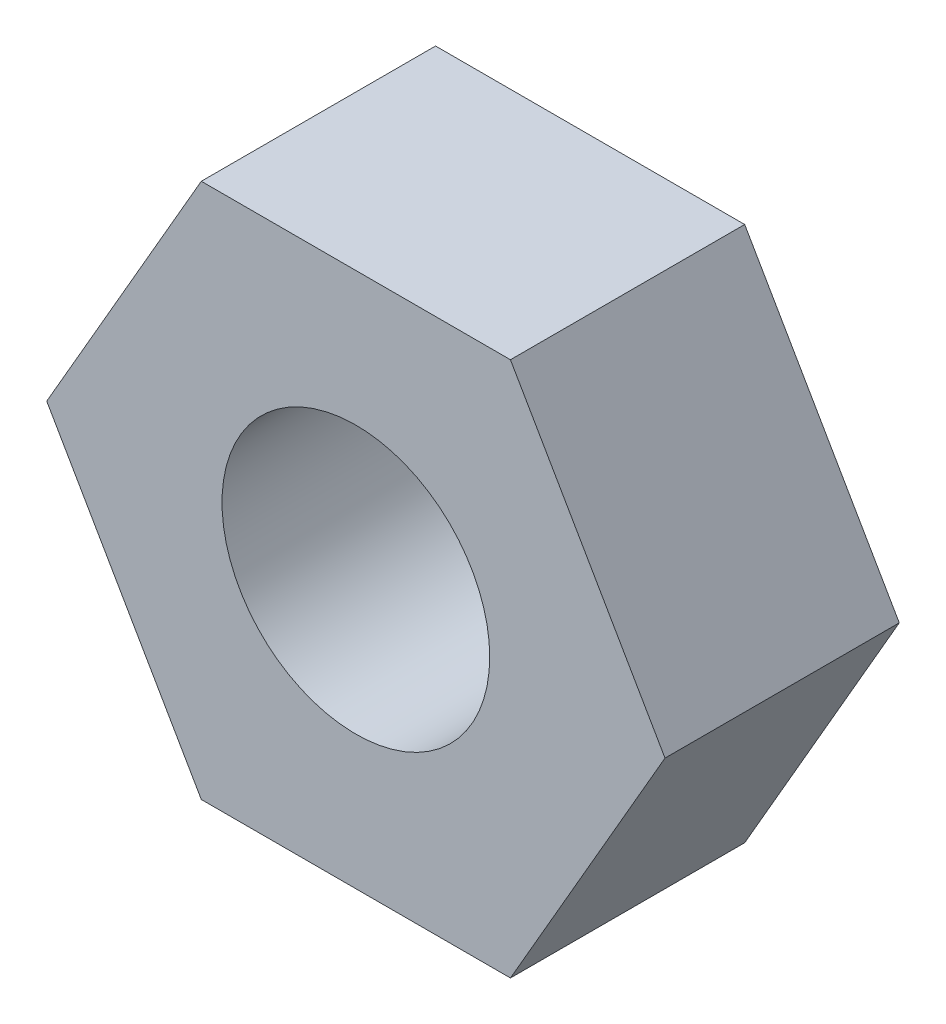
ISO-10303-21;
HEADER;
FILE_DESCRIPTION(('STEP AP214'),'2;1');
FILE_NAME('part.step','',(''),(''),'','','');
FILE_SCHEMA(('AUTOMOTIVE_DESIGN { 1 0 10303 214 1 1 1 1 }'));
ENDSEC;
DATA;
#1=APPLICATION_CONTEXT('core data for automotive mechanical design processes');
#2=APPLICATION_PROTOCOL_DEFINITION('international standard','automotive_design',2000,#1);
#3=PRODUCT_CONTEXT('',#1,'mechanical');
#4=PRODUCT('Part','Part','',(#3));
#5=PRODUCT_RELATED_PRODUCT_CATEGORY('part','',(#4));
#6=PRODUCT_DEFINITION_FORMATION('','',#4);
#7=PRODUCT_DEFINITION_CONTEXT('part definition',#1,'design');
#8=PRODUCT_DEFINITION('design','',#6,#7);
#9=PRODUCT_DEFINITION_SHAPE('','',#8);
#10=(LENGTH_UNIT() NAMED_UNIT(*) SI_UNIT(.MILLI.,.METRE.));
#11=(NAMED_UNIT(*) PLANE_ANGLE_UNIT() SI_UNIT($,.RADIAN.));
#12=(NAMED_UNIT(*) SI_UNIT($,.STERADIAN.) SOLID_ANGLE_UNIT());
#13=UNCERTAINTY_MEASURE_WITH_UNIT(LENGTH_MEASURE(1.E-05),#10,'distance_accuracy_value','');
#14=(GEOMETRIC_REPRESENTATION_CONTEXT(3) GLOBAL_UNCERTAINTY_ASSIGNED_CONTEXT((#13)) GLOBAL_UNIT_ASSIGNED_CONTEXT((#10,
#11,#12)) REPRESENTATION_CONTEXT('',''));
#15=CARTESIAN_POINT('',(0.,0.,0.));
#16=DIRECTION('',(0.,0.,1.));
#17=DIRECTION('',(1.,0.,0.));
#18=AXIS2_PLACEMENT_3D('',#15,#16,#17);
#19=CARTESIAN_POINT('',(0.,0.,14.));
#20=DIRECTION('',(0.,0.,1.));
#21=DIRECTION('',(1.,0.,0.));
#22=AXIS2_PLACEMENT_3D('',#19,#20,#21);
#23=PLANE('',#22);
#24=DIRECTION('',(-1.,0.,0.));
#25=VECTOR('',#24,1.);
#26=CARTESIAN_POINT('',(9.23760430703395,16.,14.));
#27=LINE('',#26,#25);
#28=CARTESIAN_POINT('',(9.23760430703395,16.,14.));
#29=VERTEX_POINT('',#28);
#30=CARTESIAN_POINT('',(-9.23760430703405,15.9999999999999,14.));
#31=VERTEX_POINT('',#30);
#32=EDGE_CURVE('E150',#29,#31,#27,.T.);
#33=ORIENTED_EDGE('',*,*,#32,.T.);
#34=DIRECTION('',(-0.499999999999995,-0.866025403784442,0.));
#35=VECTOR('',#34,1.);
#36=CARTESIAN_POINT('',(-9.23760430703405,15.9999999999999,14.));
#37=LINE('',#36,#35);
#38=CARTESIAN_POINT('',(-18.475208614068,-1.29011692214504E-13,14.));
#39=VERTEX_POINT('',#38);
#40=EDGE_CURVE('E108',#31,#39,#37,.T.);
#41=ORIENTED_EDGE('',*,*,#40,.T.);
#42=DIRECTION('',(0.500000000000007,-0.866025403784435,0.));
#43=VECTOR('',#42,1.);
#44=CARTESIAN_POINT('',(-18.475208614068,-1.29011692214504E-13,14.));
#45=LINE('',#44,#43);
#46=CARTESIAN_POINT('',(-9.23760430703383,-16.,14.));
#47=VERTEX_POINT('',#46);
#48=EDGE_CURVE('E121',#39,#47,#45,.T.);
#49=ORIENTED_EDGE('',*,*,#48,.T.);
#50=DIRECTION('',(1.,0.,0.));
#51=VECTOR('',#50,1.);
#52=CARTESIAN_POINT('',(-9.23760430703383,-16.,14.));
#53=LINE('',#52,#51);
#54=CARTESIAN_POINT('',(9.23760430703417,-15.9999999999998,14.));
#55=VERTEX_POINT('',#54);
#56=EDGE_CURVE('E115',#47,#55,#53,.T.);
#57=ORIENTED_EDGE('',*,*,#56,.T.);
#58=DIRECTION('',(0.499999999999995,0.866025403784441,0.));
#59=VECTOR('',#58,1.);
#60=CARTESIAN_POINT('',(9.23760430703417,-15.9999999999998,14.));
#61=LINE('',#60,#59);
#62=CARTESIAN_POINT('',(18.475208614068,0.,14.));
#63=VERTEX_POINT('',#62);
#64=EDGE_CURVE('E119',#55,#63,#61,.T.);
#65=ORIENTED_EDGE('',*,*,#64,.T.);
#66=DIRECTION('',(-0.500000000000001,0.866025403784438,0.));
#67=VECTOR('',#66,1.);
#68=CARTESIAN_POINT('',(18.475208614068,0.,14.));
#69=LINE('',#68,#67);
#70=EDGE_CURVE('E71',#63,#29,#69,.T.);
#71=ORIENTED_EDGE('',*,*,#70,.T.);
#72=EDGE_LOOP('',(#33,#41,#49,#57,#65,#71));
#73=FACE_BOUND('',#72,.T.);
#74=CARTESIAN_POINT('',(0.,0.,14.));
#75=DIRECTION('',(0.,0.,1.));
#76=DIRECTION('',(1.,0.,0.));
#77=AXIS2_PLACEMENT_3D('',#74,#75,#76);
#78=CIRCLE('',#77,8.);
#79=CARTESIAN_POINT('',(8.,0.,14.));
#80=VERTEX_POINT('',#79);
#81=EDGE_CURVE('E143',#80,#80,#78,.T.);
#82=ORIENTED_EDGE('',*,*,#81,.F.);
#83=EDGE_LOOP('',(#82));
#84=FACE_BOUND('',#83,.T.);
#85=ADVANCED_FACE('F54',(#73,#84),#23,.T.);
#86=CARTESIAN_POINT('',(0.,0.,0.));
#87=DIRECTION('',(0.,0.,1.));
#88=DIRECTION('',(1.,0.,0.));
#89=AXIS2_PLACEMENT_3D('',#86,#87,#88);
#90=PLANE('',#89);
#91=DIRECTION('',(-1.,0.,0.));
#92=VECTOR('',#91,1.);
#93=CARTESIAN_POINT('',(9.23760430703395,16.,0.));
#94=LINE('',#93,#92);
#95=CARTESIAN_POINT('',(9.23760430703395,16.,0.));
#96=VERTEX_POINT('',#95);
#97=CARTESIAN_POINT('',(-9.23760430703405,15.9999999999999,0.));
#98=VERTEX_POINT('',#97);
#99=EDGE_CURVE('E139',#96,#98,#94,.T.);
#100=ORIENTED_EDGE('',*,*,#99,.F.);
#101=DIRECTION('',(-0.500000000000001,0.866025403784438,0.));
#102=VECTOR('',#101,1.);
#103=CARTESIAN_POINT('',(18.475208614068,0.,0.));
#104=LINE('',#103,#102);
#105=CARTESIAN_POINT('',(18.475208614068,0.,0.));
#106=VERTEX_POINT('',#105);
#107=EDGE_CURVE('E100',#106,#96,#104,.T.);
#108=ORIENTED_EDGE('',*,*,#107,.F.);
#109=DIRECTION('',(0.499999999999995,0.866025403784441,0.));
#110=VECTOR('',#109,1.);
#111=CARTESIAN_POINT('',(9.23760430703417,-15.9999999999998,0.));
#112=LINE('',#111,#110);
#113=CARTESIAN_POINT('',(9.23760430703417,-15.9999999999998,0.));
#114=VERTEX_POINT('',#113);
#115=EDGE_CURVE('E94',#114,#106,#112,.T.);
#116=ORIENTED_EDGE('',*,*,#115,.F.);
#117=DIRECTION('',(1.,0.,0.));
#118=VECTOR('',#117,1.);
#119=CARTESIAN_POINT('',(-9.23760430703383,-16.,0.));
#120=LINE('',#119,#118);
#121=CARTESIAN_POINT('',(-9.23760430703383,-16.,0.));
#122=VERTEX_POINT('',#121);
#123=EDGE_CURVE('E129',#122,#114,#120,.T.);
#124=ORIENTED_EDGE('',*,*,#123,.F.);
#125=DIRECTION('',(0.500000000000007,-0.866025403784435,0.));
#126=VECTOR('',#125,1.);
#127=CARTESIAN_POINT('',(-18.475208614068,-1.29011692214504E-13,0.));
#128=LINE('',#127,#126);
#129=CARTESIAN_POINT('',(-18.475208614068,-1.29011692214504E-13,0.));
#130=VERTEX_POINT('',#129);
#131=EDGE_CURVE('E145',#130,#122,#128,.T.);
#132=ORIENTED_EDGE('',*,*,#131,.F.);
#133=DIRECTION('',(-0.499999999999995,-0.866025403784442,0.));
#134=VECTOR('',#133,1.);
#135=CARTESIAN_POINT('',(-9.23760430703405,15.9999999999999,0.));
#136=LINE('',#135,#134);
#137=EDGE_CURVE('E142',#98,#130,#136,.T.);
#138=ORIENTED_EDGE('',*,*,#137,.F.);
#139=EDGE_LOOP('',(#100,#108,#116,#124,#132,#138));
#140=FACE_BOUND('',#139,.T.);
#141=CARTESIAN_POINT('',(0.,0.,0.));
#142=DIRECTION('',(0.,0.,1.));
#143=DIRECTION('',(1.,0.,0.));
#144=AXIS2_PLACEMENT_3D('',#141,#142,#143);
#145=CIRCLE('',#144,8.);
#146=CARTESIAN_POINT('',(8.,0.,0.));
#147=VERTEX_POINT('',#146);
#148=EDGE_CURVE('E243',#147,#147,#145,.T.);
#149=ORIENTED_EDGE('',*,*,#148,.T.);
#150=EDGE_LOOP('',(#149));
#151=FACE_BOUND('',#150,.T.);
#152=ADVANCED_FACE('F159',(#140,#151),#90,.F.);
#153=CARTESIAN_POINT('',(9.23760430703395,16.,14.));
#154=DIRECTION('',(0.,-1.,0.));
#155=DIRECTION('',(1.,0.,0.));
#156=AXIS2_PLACEMENT_3D('',#153,#154,#155);
#157=PLANE('',#156);
#158=ORIENTED_EDGE('',*,*,#99,.T.);
#159=DIRECTION('',(0.,0.,-1.));
#160=VECTOR('',#159,1.);
#161=CARTESIAN_POINT('',(-9.23760430703405,15.9999999999999,14.));
#162=LINE('',#161,#160);
#163=EDGE_CURVE('E12',#31,#98,#162,.T.);
#164=ORIENTED_EDGE('',*,*,#163,.F.);
#165=ORIENTED_EDGE('',*,*,#32,.F.);
#166=DIRECTION('',(0.,0.,-1.));
#167=VECTOR('',#166,1.);
#168=CARTESIAN_POINT('',(9.23760430703395,16.,14.));
#169=LINE('',#168,#167);
#170=EDGE_CURVE('E135',#29,#96,#169,.T.);
#171=ORIENTED_EDGE('',*,*,#170,.T.);
#172=EDGE_LOOP('',(#158,#164,#165,#171));
#173=FACE_BOUND('',#172,.T.);
#174=ADVANCED_FACE('F56',(#173),#157,.F.);
#175=CARTESIAN_POINT('',(-9.23760430703405,15.9999999999999,14.));
#176=DIRECTION('',(0.866025403784442,-0.499999999999995,0.));
#177=DIRECTION('',(0.499999999999995,0.866025403784442,0.));
#178=AXIS2_PLACEMENT_3D('',#175,#176,#177);
#179=PLANE('',#178);
#180=ORIENTED_EDGE('',*,*,#137,.T.);
#181=DIRECTION('',(0.,0.,-1.));
#182=VECTOR('',#181,1.);
#183=CARTESIAN_POINT('',(-18.475208614068,-1.29011692214504E-13,14.));
#184=LINE('',#183,#182);
#185=EDGE_CURVE('E63',#39,#130,#184,.T.);
#186=ORIENTED_EDGE('',*,*,#185,.F.);
#187=ORIENTED_EDGE('',*,*,#40,.F.);
#188=ORIENTED_EDGE('',*,*,#163,.T.);
#189=EDGE_LOOP('',(#180,#186,#187,#188));
#190=FACE_BOUND('',#189,.T.);
#191=ADVANCED_FACE('F184',(#190),#179,.F.);
#192=CARTESIAN_POINT('',(-18.475208614068,-1.29011692214504E-13,14.));
#193=DIRECTION('',(0.866025403784435,0.500000000000007,0.));
#194=DIRECTION('',(-0.500000000000007,0.866025403784435,0.));
#195=AXIS2_PLACEMENT_3D('',#192,#193,#194);
#196=PLANE('',#195);
#197=ORIENTED_EDGE('',*,*,#131,.T.);
#198=DIRECTION('',(0.,0.,-1.));
#199=VECTOR('',#198,1.);
#200=CARTESIAN_POINT('',(-9.23760430703383,-16.,14.));
#201=LINE('',#200,#199);
#202=EDGE_CURVE('E130',#47,#122,#201,.T.);
#203=ORIENTED_EDGE('',*,*,#202,.F.);
#204=ORIENTED_EDGE('',*,*,#48,.F.);
#205=ORIENTED_EDGE('',*,*,#185,.T.);
#206=EDGE_LOOP('',(#197,#203,#204,#205));
#207=FACE_BOUND('',#206,.T.);
#208=ADVANCED_FACE('F156',(#207),#196,.F.);
#209=CARTESIAN_POINT('',(-9.23760430703383,-16.,14.));
#210=DIRECTION('',(0.,1.,0.));
#211=DIRECTION('',(-1.,0.,0.));
#212=AXIS2_PLACEMENT_3D('',#209,#210,#211);
#213=PLANE('',#212);
#214=ORIENTED_EDGE('',*,*,#123,.T.);
#215=DIRECTION('',(0.,0.,-1.));
#216=VECTOR('',#215,1.);
#217=CARTESIAN_POINT('',(9.23760430703417,-15.9999999999998,14.));
#218=LINE('',#217,#216);
#219=EDGE_CURVE('E126',#55,#114,#218,.T.);
#220=ORIENTED_EDGE('',*,*,#219,.F.);
#221=ORIENTED_EDGE('',*,*,#56,.F.);
#222=ORIENTED_EDGE('',*,*,#202,.T.);
#223=EDGE_LOOP('',(#214,#220,#221,#222));
#224=FACE_BOUND('',#223,.T.);
#225=ADVANCED_FACE('F127',(#224),#213,.F.);
#226=CARTESIAN_POINT('',(9.23760430703417,-15.9999999999998,14.));
#227=DIRECTION('',(-0.866025403784441,0.499999999999995,0.));
#228=DIRECTION('',(-0.499999999999995,-0.866025403784441,0.));
#229=AXIS2_PLACEMENT_3D('',#226,#227,#228);
#230=PLANE('',#229);
#231=ORIENTED_EDGE('',*,*,#115,.T.);
#232=DIRECTION('',(0.,0.,-1.));
#233=VECTOR('',#232,1.);
#234=CARTESIAN_POINT('',(18.475208614068,0.,14.));
#235=LINE('',#234,#233);
#236=EDGE_CURVE('E131',#63,#106,#235,.T.);
#237=ORIENTED_EDGE('',*,*,#236,.F.);
#238=ORIENTED_EDGE('',*,*,#64,.F.);
#239=ORIENTED_EDGE('',*,*,#219,.T.);
#240=EDGE_LOOP('',(#231,#237,#238,#239));
#241=FACE_BOUND('',#240,.T.);
#242=ADVANCED_FACE('F133',(#241),#230,.F.);
#243=CARTESIAN_POINT('',(18.475208614068,0.,14.));
#244=DIRECTION('',(-0.866025403784438,-0.500000000000001,0.));
#245=DIRECTION('',(0.500000000000001,-0.866025403784438,0.));
#246=AXIS2_PLACEMENT_3D('',#243,#244,#245);
#247=PLANE('',#246);
#248=ORIENTED_EDGE('',*,*,#107,.T.);
#249=ORIENTED_EDGE('',*,*,#170,.F.);
#250=ORIENTED_EDGE('',*,*,#70,.F.);
#251=ORIENTED_EDGE('',*,*,#236,.T.);
#252=EDGE_LOOP('',(#248,#249,#250,#251));
#253=FACE_BOUND('',#252,.T.);
#254=ADVANCED_FACE('F164',(#253),#247,.F.);
#255=CARTESIAN_POINT('',(0.,0.,14.));
#256=DIRECTION('',(0.,0.,-1.));
#257=DIRECTION('',(-1.,0.,0.));
#258=AXIS2_PLACEMENT_3D('',#255,#256,#257);
#259=CYLINDRICAL_SURFACE('',#258,8.);
#260=ORIENTED_EDGE('',*,*,#81,.T.);
#261=EDGE_LOOP('',(#260));
#262=FACE_BOUND('',#261,.T.);
#263=ORIENTED_EDGE('',*,*,#148,.F.);
#264=EDGE_LOOP('',(#263));
#265=FACE_BOUND('',#264,.T.);
#266=ADVANCED_FACE('F166',(#262,#265),#259,.F.);
#267=CLOSED_SHELL('',(#85,#152,#174,#191,#208,#225,#242,#254,#266));
#268=MANIFOLD_SOLID_BREP('B2',#267);
#269=ADVANCED_BREP_SHAPE_REPRESENTATION('',(#18,#268),#14);
#270=SHAPE_DEFINITION_REPRESENTATION(#9,#269);
ENDSEC;
END-ISO-10303-21;
